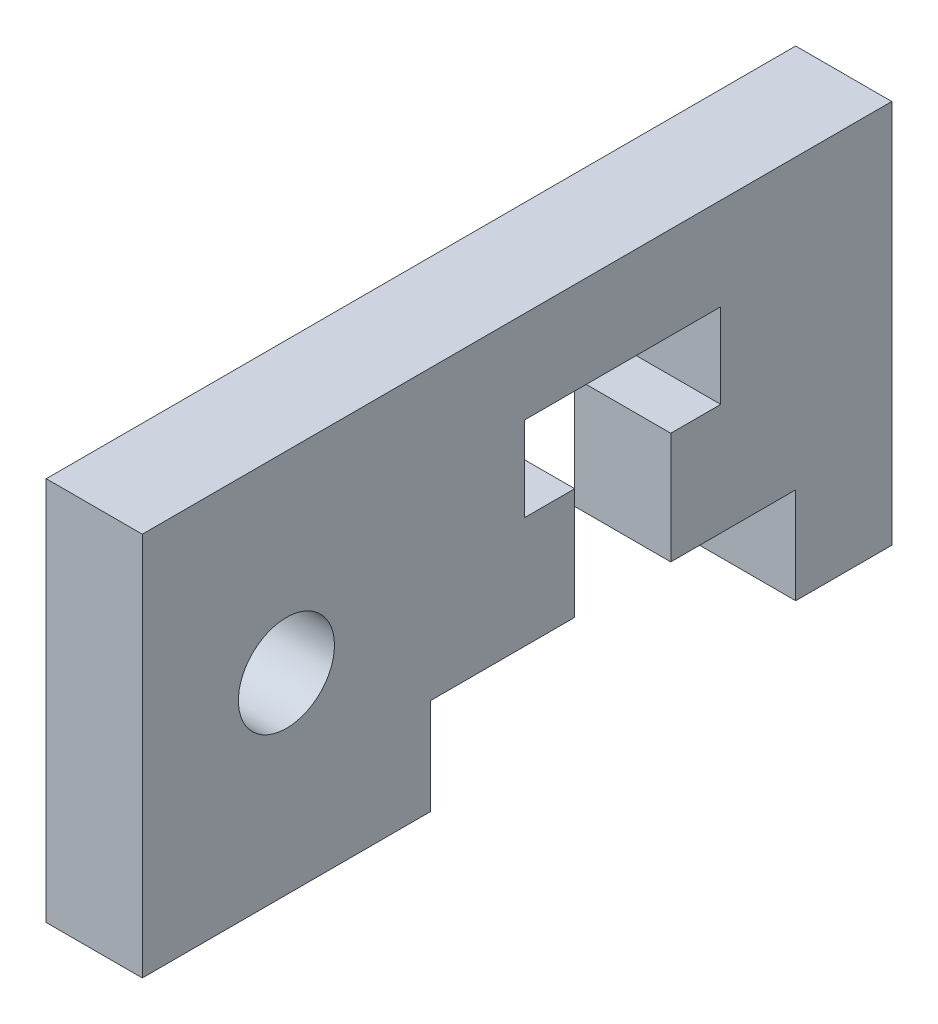
ISO-10303-21;
HEADER;
FILE_DESCRIPTION(('STEP AP214'),'2;1');
FILE_NAME('part.step','',(''),(''),'','','');
FILE_SCHEMA(('AUTOMOTIVE_DESIGN { 1 0 10303 214 1 1 1 1 }'));
ENDSEC;
DATA;
#1=APPLICATION_CONTEXT('core data for automotive mechanical design processes');
#2=APPLICATION_PROTOCOL_DEFINITION('international standard','automotive_design',2000,#1);
#3=PRODUCT_CONTEXT('',#1,'mechanical');
#4=PRODUCT('Part','Part','',(#3));
#5=PRODUCT_RELATED_PRODUCT_CATEGORY('part','',(#4));
#6=PRODUCT_DEFINITION_FORMATION('','',#4);
#7=PRODUCT_DEFINITION_CONTEXT('part definition',#1,'design');
#8=PRODUCT_DEFINITION('design','',#6,#7);
#9=PRODUCT_DEFINITION_SHAPE('','',#8);
#10=(LENGTH_UNIT() NAMED_UNIT(*) SI_UNIT(.MILLI.,.METRE.));
#11=(NAMED_UNIT(*) PLANE_ANGLE_UNIT() SI_UNIT($,.RADIAN.));
#12=(NAMED_UNIT(*) SI_UNIT($,.STERADIAN.) SOLID_ANGLE_UNIT());
#13=UNCERTAINTY_MEASURE_WITH_UNIT(LENGTH_MEASURE(1.E-05),#10,'distance_accuracy_value','');
#14=(GEOMETRIC_REPRESENTATION_CONTEXT(3) GLOBAL_UNCERTAINTY_ASSIGNED_CONTEXT((#13)) GLOBAL_UNIT_ASSIGNED_CONTEXT((#10,
#11,#12)) REPRESENTATION_CONTEXT('',''));
#15=CARTESIAN_POINT('',(0.,0.,0.));
#16=DIRECTION('',(0.,0.,1.));
#17=DIRECTION('',(1.,0.,0.));
#18=AXIS2_PLACEMENT_3D('',#15,#16,#17);
#19=CARTESIAN_POINT('',(-1.5875,6.35,-20.0025));
#20=DIRECTION('',(0.,1.,0.));
#21=DIRECTION('',(0.,0.,1.));
#22=AXIS2_PLACEMENT_3D('',#19,#20,#21);
#23=PLANE('',#22);
#24=DIRECTION('',(1.,0.,0.));
#25=VECTOR('',#24,1.);
#26=CARTESIAN_POINT('',(-1.5875,6.35,4.7625));
#27=LINE('',#26,#25);
#28=CARTESIAN_POINT('',(-1.5875,6.35,4.7625));
#29=VERTEX_POINT('',#28);
#30=CARTESIAN_POINT('',(1.5875,6.35,4.7625));
#31=VERTEX_POINT('',#30);
#32=EDGE_CURVE('E36',#29,#31,#27,.T.);
#33=ORIENTED_EDGE('',*,*,#32,.T.);
#34=DIRECTION('',(0.,0.,1.));
#35=VECTOR('',#34,1.);
#36=CARTESIAN_POINT('',(1.5875,6.35,-20.0025));
#37=LINE('',#36,#35);
#38=CARTESIAN_POINT('',(1.5875,6.35,-20.0025));
#39=VERTEX_POINT('',#38);
#40=EDGE_CURVE('E145',#39,#31,#37,.T.);
#41=ORIENTED_EDGE('',*,*,#40,.F.);
#42=DIRECTION('',(1.,0.,0.));
#43=VECTOR('',#42,1.);
#44=CARTESIAN_POINT('',(-1.5875,6.35,-20.0025));
#45=LINE('',#44,#43);
#46=CARTESIAN_POINT('',(-1.5875,6.35,-20.0025));
#47=VERTEX_POINT('',#46);
#48=EDGE_CURVE('E11',#47,#39,#45,.T.);
#49=ORIENTED_EDGE('',*,*,#48,.F.);
#50=DIRECTION('',(0.,0.,1.));
#51=VECTOR('',#50,1.);
#52=CARTESIAN_POINT('',(-1.5875,6.35,-20.0025));
#53=LINE('',#52,#51);
#54=EDGE_CURVE('E146',#47,#29,#53,.T.);
#55=ORIENTED_EDGE('',*,*,#54,.T.);
#56=EDGE_LOOP('',(#33,#41,#49,#55));
#57=FACE_BOUND('',#56,.T.);
#58=ADVANCED_FACE('F33',(#57),#23,.T.);
#59=CARTESIAN_POINT('',(-1.5875,-6.35,-20.0025));
#60=DIRECTION('',(0.,0.,-1.));
#61=DIRECTION('',(0.,1.,0.));
#62=AXIS2_PLACEMENT_3D('',#59,#60,#61);
#63=PLANE('',#62);
#64=ORIENTED_EDGE('',*,*,#48,.T.);
#65=DIRECTION('',(0.,1.,0.));
#66=VECTOR('',#65,1.);
#67=CARTESIAN_POINT('',(1.5875,-6.35,-20.0025));
#68=LINE('',#67,#66);
#69=CARTESIAN_POINT('',(1.5875,-6.35,-20.0025));
#70=VERTEX_POINT('',#69);
#71=EDGE_CURVE('E164',#70,#39,#68,.T.);
#72=ORIENTED_EDGE('',*,*,#71,.F.);
#73=DIRECTION('',(1.,0.,0.));
#74=VECTOR('',#73,1.);
#75=CARTESIAN_POINT('',(-1.5875,-6.35,-20.0025));
#76=LINE('',#75,#74);
#77=CARTESIAN_POINT('',(-1.5875,-6.35,-20.0025));
#78=VERTEX_POINT('',#77);
#79=EDGE_CURVE('E41',#78,#70,#76,.T.);
#80=ORIENTED_EDGE('',*,*,#79,.F.);
#81=DIRECTION('',(0.,1.,0.));
#82=VECTOR('',#81,1.);
#83=CARTESIAN_POINT('',(-1.5875,-6.35,-20.0025));
#84=LINE('',#83,#82);
#85=EDGE_CURVE('E151',#78,#47,#84,.T.);
#86=ORIENTED_EDGE('',*,*,#85,.T.);
#87=EDGE_LOOP('',(#64,#72,#80,#86));
#88=FACE_BOUND('',#87,.T.);
#89=ADVANCED_FACE('F330',(#88),#63,.T.);
#90=CARTESIAN_POINT('',(-1.5875,-6.35,-16.8275));
#91=DIRECTION('',(0.,-1.,0.));
#92=DIRECTION('',(0.,0.,-1.));
#93=AXIS2_PLACEMENT_3D('',#90,#91,#92);
#94=PLANE('',#93);
#95=ORIENTED_EDGE('',*,*,#79,.T.);
#96=DIRECTION('',(0.,0.,-1.));
#97=VECTOR('',#96,1.);
#98=CARTESIAN_POINT('',(1.5875,-6.35,-16.8275));
#99=LINE('',#98,#97);
#100=CARTESIAN_POINT('',(1.5875,-6.35,-16.8275));
#101=VERTEX_POINT('',#100);
#102=EDGE_CURVE('E204',#101,#70,#99,.T.);
#103=ORIENTED_EDGE('',*,*,#102,.F.);
#104=DIRECTION('',(1.,0.,0.));
#105=VECTOR('',#104,1.);
#106=CARTESIAN_POINT('',(-1.5875,-6.35,-16.8275));
#107=LINE('',#106,#105);
#108=CARTESIAN_POINT('',(-1.5875,-6.35,-16.8275));
#109=VERTEX_POINT('',#108);
#110=EDGE_CURVE('E253',#109,#101,#107,.T.);
#111=ORIENTED_EDGE('',*,*,#110,.F.);
#112=DIRECTION('',(0.,0.,-1.));
#113=VECTOR('',#112,1.);
#114=CARTESIAN_POINT('',(-1.5875,-6.35,-16.8275));
#115=LINE('',#114,#113);
#116=EDGE_CURVE('E249',#109,#78,#115,.T.);
#117=ORIENTED_EDGE('',*,*,#116,.T.);
#118=EDGE_LOOP('',(#95,#103,#111,#117));
#119=FACE_BOUND('',#118,.T.);
#120=ADVANCED_FACE('F328',(#119),#94,.T.);
#121=CARTESIAN_POINT('',(-1.5875,-3.175,-16.8275));
#122=DIRECTION('',(0.,0.,1.));
#123=DIRECTION('',(1.,0.,0.));
#124=AXIS2_PLACEMENT_3D('',#121,#122,#123);
#125=PLANE('',#124);
#126=ORIENTED_EDGE('',*,*,#110,.T.);
#127=DIRECTION('',(0.,-1.,0.));
#128=VECTOR('',#127,1.);
#129=CARTESIAN_POINT('',(1.5875,-3.175,-16.8275));
#130=LINE('',#129,#128);
#131=CARTESIAN_POINT('',(1.5875,-3.175,-16.8275));
#132=VERTEX_POINT('',#131);
#133=EDGE_CURVE('E201',#132,#101,#130,.T.);
#134=ORIENTED_EDGE('',*,*,#133,.F.);
#135=DIRECTION('',(1.,0.,0.));
#136=VECTOR('',#135,1.);
#137=CARTESIAN_POINT('',(-1.5875,-3.175,-16.8275));
#138=LINE('',#137,#136);
#139=CARTESIAN_POINT('',(-1.5875,-3.175,-16.8275));
#140=VERTEX_POINT('',#139);
#141=EDGE_CURVE('E255',#140,#132,#138,.T.);
#142=ORIENTED_EDGE('',*,*,#141,.F.);
#143=DIRECTION('',(0.,-1.,0.));
#144=VECTOR('',#143,1.);
#145=CARTESIAN_POINT('',(-1.5875,-3.175,-16.8275));
#146=LINE('',#145,#144);
#147=EDGE_CURVE('E246',#140,#109,#146,.T.);
#148=ORIENTED_EDGE('',*,*,#147,.T.);
#149=EDGE_LOOP('',(#126,#134,#142,#148));
#150=FACE_BOUND('',#149,.T.);
#151=ADVANCED_FACE('F324',(#150),#125,.T.);
#152=CARTESIAN_POINT('',(-1.5875,-3.175,-12.7));
#153=DIRECTION('',(0.,-1.,0.));
#154=DIRECTION('',(0.,0.,-1.));
#155=AXIS2_PLACEMENT_3D('',#152,#153,#154);
#156=PLANE('',#155);
#157=ORIENTED_EDGE('',*,*,#141,.T.);
#158=DIRECTION('',(0.,0.,-1.));
#159=VECTOR('',#158,1.);
#160=CARTESIAN_POINT('',(1.5875,-3.175,-12.7));
#161=LINE('',#160,#159);
#162=CARTESIAN_POINT('',(1.5875,-3.175,-12.7));
#163=VERTEX_POINT('',#162);
#164=EDGE_CURVE('E198',#163,#132,#161,.T.);
#165=ORIENTED_EDGE('',*,*,#164,.F.);
#166=DIRECTION('',(1.,0.,0.));
#167=VECTOR('',#166,1.);
#168=CARTESIAN_POINT('',(-1.5875,-3.175,-12.7));
#169=LINE('',#168,#167);
#170=CARTESIAN_POINT('',(-1.5875,-3.175,-12.7));
#171=VERTEX_POINT('',#170);
#172=EDGE_CURVE('E257',#171,#163,#169,.T.);
#173=ORIENTED_EDGE('',*,*,#172,.F.);
#174=DIRECTION('',(0.,0.,-1.));
#175=VECTOR('',#174,1.);
#176=CARTESIAN_POINT('',(-1.5875,-3.175,-12.7));
#177=LINE('',#176,#175);
#178=EDGE_CURVE('E243',#171,#140,#177,.T.);
#179=ORIENTED_EDGE('',*,*,#178,.T.);
#180=EDGE_LOOP('',(#157,#165,#173,#179));
#181=FACE_BOUND('',#180,.T.);
#182=ADVANCED_FACE('F322',(#181),#156,.T.);
#183=CARTESIAN_POINT('',(-1.5875,-3.175,-12.7));
#184=DIRECTION('',(0.,0.,1.));
#185=DIRECTION('',(1.,0.,0.));
#186=AXIS2_PLACEMENT_3D('',#183,#184,#185);
#187=PLANE('',#186);
#188=ORIENTED_EDGE('',*,*,#172,.T.);
#189=DIRECTION('',(0.,-1.,0.));
#190=VECTOR('',#189,1.);
#191=CARTESIAN_POINT('',(1.5875,-3.175,-12.7));
#192=LINE('',#191,#190);
#193=CARTESIAN_POINT('',(1.5875,0.507999999999998,-12.7));
#194=VERTEX_POINT('',#193);
#195=EDGE_CURVE('E195',#194,#163,#192,.T.);
#196=ORIENTED_EDGE('',*,*,#195,.F.);
#197=DIRECTION('',(1.,0.,0.));
#198=VECTOR('',#197,1.);
#199=CARTESIAN_POINT('',(-1.5875,0.507999999999998,-12.7));
#200=LINE('',#199,#198);
#201=CARTESIAN_POINT('',(-1.5875,0.507999999999998,-12.7));
#202=VERTEX_POINT('',#201);
#203=EDGE_CURVE('E259',#202,#194,#200,.T.);
#204=ORIENTED_EDGE('',*,*,#203,.F.);
#205=DIRECTION('',(0.,-1.,0.));
#206=VECTOR('',#205,1.);
#207=CARTESIAN_POINT('',(-1.5875,-3.175,-12.7));
#208=LINE('',#207,#206);
#209=EDGE_CURVE('E240',#202,#171,#208,.T.);
#210=ORIENTED_EDGE('',*,*,#209,.T.);
#211=EDGE_LOOP('',(#188,#196,#204,#210));
#212=FACE_BOUND('',#211,.T.);
#213=ADVANCED_FACE('F317',(#212),#187,.T.);
#214=CARTESIAN_POINT('',(-1.5875,0.507999999999998,-12.7));
#215=DIRECTION('',(0.,1.,0.));
#216=DIRECTION('',(0.,0.,1.));
#217=AXIS2_PLACEMENT_3D('',#214,#215,#216);
#218=PLANE('',#217);
#219=ORIENTED_EDGE('',*,*,#203,.T.);
#220=DIRECTION('',(0.,0.,1.));
#221=VECTOR('',#220,1.);
#222=CARTESIAN_POINT('',(1.5875,0.507999999999998,-12.7));
#223=LINE('',#222,#221);
#224=CARTESIAN_POINT('',(1.5875,0.507999999999998,-14.351));
#225=VERTEX_POINT('',#224);
#226=EDGE_CURVE('E192',#225,#194,#223,.T.);
#227=ORIENTED_EDGE('',*,*,#226,.F.);
#228=DIRECTION('',(1.,0.,0.));
#229=VECTOR('',#228,1.);
#230=CARTESIAN_POINT('',(-1.5875,0.507999999999998,-14.351));
#231=LINE('',#230,#229);
#232=CARTESIAN_POINT('',(-1.5875,0.507999999999998,-14.351));
#233=VERTEX_POINT('',#232);
#234=EDGE_CURVE('E261',#233,#225,#231,.T.);
#235=ORIENTED_EDGE('',*,*,#234,.F.);
#236=DIRECTION('',(0.,0.,1.));
#237=VECTOR('',#236,1.);
#238=CARTESIAN_POINT('',(-1.5875,0.507999999999998,-12.7));
#239=LINE('',#238,#237);
#240=EDGE_CURVE('E237',#233,#202,#239,.T.);
#241=ORIENTED_EDGE('',*,*,#240,.T.);
#242=EDGE_LOOP('',(#219,#227,#235,#241));
#243=FACE_BOUND('',#242,.T.);
#244=ADVANCED_FACE('F312',(#243),#218,.T.);
#245=CARTESIAN_POINT('',(-1.5875,0.507999999999998,-14.351));
#246=DIRECTION('',(0.,0.,1.));
#247=DIRECTION('',(1.,0.,0.));
#248=AXIS2_PLACEMENT_3D('',#245,#246,#247);
#249=PLANE('',#248);
#250=ORIENTED_EDGE('',*,*,#234,.T.);
#251=DIRECTION('',(0.,-1.,0.));
#252=VECTOR('',#251,1.);
#253=CARTESIAN_POINT('',(1.5875,0.507999999999998,-14.351));
#254=LINE('',#253,#252);
#255=CARTESIAN_POINT('',(1.5875,3.302,-14.351));
#256=VERTEX_POINT('',#255);
#257=EDGE_CURVE('E189',#256,#225,#254,.T.);
#258=ORIENTED_EDGE('',*,*,#257,.F.);
#259=DIRECTION('',(1.,0.,0.));
#260=VECTOR('',#259,1.);
#261=CARTESIAN_POINT('',(-1.5875,3.302,-14.351));
#262=LINE('',#261,#260);
#263=CARTESIAN_POINT('',(-1.5875,3.302,-14.351));
#264=VERTEX_POINT('',#263);
#265=EDGE_CURVE('E263',#264,#256,#262,.T.);
#266=ORIENTED_EDGE('',*,*,#265,.F.);
#267=DIRECTION('',(0.,-1.,0.));
#268=VECTOR('',#267,1.);
#269=CARTESIAN_POINT('',(-1.5875,0.507999999999998,-14.351));
#270=LINE('',#269,#268);
#271=EDGE_CURVE('E234',#264,#233,#270,.T.);
#272=ORIENTED_EDGE('',*,*,#271,.T.);
#273=EDGE_LOOP('',(#250,#258,#266,#272));
#274=FACE_BOUND('',#273,.T.);
#275=ADVANCED_FACE('F310',(#274),#249,.T.);
#276=CARTESIAN_POINT('',(-1.5875,3.302,-14.351));
#277=DIRECTION('',(0.,-1.,0.));
#278=DIRECTION('',(0.,0.,-1.));
#279=AXIS2_PLACEMENT_3D('',#276,#277,#278);
#280=PLANE('',#279);
#281=ORIENTED_EDGE('',*,*,#265,.T.);
#282=DIRECTION('',(0.,0.,-1.));
#283=VECTOR('',#282,1.);
#284=CARTESIAN_POINT('',(1.5875,3.302,-14.351));
#285=LINE('',#284,#283);
#286=CARTESIAN_POINT('',(1.5875,3.302,-7.874));
#287=VERTEX_POINT('',#286);
#288=EDGE_CURVE('E186',#287,#256,#285,.T.);
#289=ORIENTED_EDGE('',*,*,#288,.F.);
#290=DIRECTION('',(1.,0.,0.));
#291=VECTOR('',#290,1.);
#292=CARTESIAN_POINT('',(-1.5875,3.302,-7.874));
#293=LINE('',#292,#291);
#294=CARTESIAN_POINT('',(-1.5875,3.302,-7.874));
#295=VERTEX_POINT('',#294);
#296=EDGE_CURVE('E265',#295,#287,#293,.T.);
#297=ORIENTED_EDGE('',*,*,#296,.F.);
#298=DIRECTION('',(0.,0.,-1.));
#299=VECTOR('',#298,1.);
#300=CARTESIAN_POINT('',(-1.5875,3.302,-14.351));
#301=LINE('',#300,#299);
#302=EDGE_CURVE('E231',#295,#264,#301,.T.);
#303=ORIENTED_EDGE('',*,*,#302,.T.);
#304=EDGE_LOOP('',(#281,#289,#297,#303));
#305=FACE_BOUND('',#304,.T.);
#306=ADVANCED_FACE('F305',(#305),#280,.T.);
#307=CARTESIAN_POINT('',(-1.5875,3.302,-7.874));
#308=DIRECTION('',(0.,0.,-1.));
#309=DIRECTION('',(-1.,0.,0.));
#310=AXIS2_PLACEMENT_3D('',#307,#308,#309);
#311=PLANE('',#310);
#312=ORIENTED_EDGE('',*,*,#296,.T.);
#313=DIRECTION('',(0.,1.,0.));
#314=VECTOR('',#313,1.);
#315=CARTESIAN_POINT('',(1.5875,3.302,-7.874));
#316=LINE('',#315,#314);
#317=CARTESIAN_POINT('',(1.5875,0.507999999999998,-7.874));
#318=VERTEX_POINT('',#317);
#319=EDGE_CURVE('E183',#318,#287,#316,.T.);
#320=ORIENTED_EDGE('',*,*,#319,.F.);
#321=DIRECTION('',(1.,0.,0.));
#322=VECTOR('',#321,1.);
#323=CARTESIAN_POINT('',(-1.5875,0.507999999999998,-7.874));
#324=LINE('',#323,#322);
#325=CARTESIAN_POINT('',(-1.5875,0.507999999999998,-7.874));
#326=VERTEX_POINT('',#325);
#327=EDGE_CURVE('E267',#326,#318,#324,.T.);
#328=ORIENTED_EDGE('',*,*,#327,.F.);
#329=DIRECTION('',(0.,1.,0.));
#330=VECTOR('',#329,1.);
#331=CARTESIAN_POINT('',(-1.5875,3.302,-7.874));
#332=LINE('',#331,#330);
#333=EDGE_CURVE('E228',#326,#295,#332,.T.);
#334=ORIENTED_EDGE('',*,*,#333,.T.);
#335=EDGE_LOOP('',(#312,#320,#328,#334));
#336=FACE_BOUND('',#335,.T.);
#337=ADVANCED_FACE('F300',(#336),#311,.T.);
#338=CARTESIAN_POINT('',(-1.5875,0.507999999999998,-7.874));
#339=DIRECTION('',(0.,1.,0.));
#340=DIRECTION('',(0.,0.,1.));
#341=AXIS2_PLACEMENT_3D('',#338,#339,#340);
#342=PLANE('',#341);
#343=ORIENTED_EDGE('',*,*,#327,.T.);
#344=DIRECTION('',(0.,0.,1.));
#345=VECTOR('',#344,1.);
#346=CARTESIAN_POINT('',(1.5875,0.507999999999998,-7.874));
#347=LINE('',#346,#345);
#348=CARTESIAN_POINT('',(1.5875,0.507999999999998,-9.525));
#349=VERTEX_POINT('',#348);
#350=EDGE_CURVE('E180',#349,#318,#347,.T.);
#351=ORIENTED_EDGE('',*,*,#350,.F.);
#352=DIRECTION('',(1.,0.,0.));
#353=VECTOR('',#352,1.);
#354=CARTESIAN_POINT('',(-1.5875,0.507999999999998,-9.525));
#355=LINE('',#354,#353);
#356=CARTESIAN_POINT('',(-1.5875,0.507999999999998,-9.525));
#357=VERTEX_POINT('',#356);
#358=EDGE_CURVE('E269',#357,#349,#355,.T.);
#359=ORIENTED_EDGE('',*,*,#358,.F.);
#360=DIRECTION('',(0.,0.,1.));
#361=VECTOR('',#360,1.);
#362=CARTESIAN_POINT('',(-1.5875,0.507999999999998,-7.874));
#363=LINE('',#362,#361);
#364=EDGE_CURVE('E225',#357,#326,#363,.T.);
#365=ORIENTED_EDGE('',*,*,#364,.T.);
#366=EDGE_LOOP('',(#343,#351,#359,#365));
#367=FACE_BOUND('',#366,.T.);
#368=ADVANCED_FACE('F298',(#367),#342,.T.);
#369=CARTESIAN_POINT('',(-1.5875,0.507999999999998,-9.525));
#370=DIRECTION('',(0.,0.,-1.));
#371=DIRECTION('',(0.,1.,0.));
#372=AXIS2_PLACEMENT_3D('',#369,#370,#371);
#373=PLANE('',#372);
#374=ORIENTED_EDGE('',*,*,#358,.T.);
#375=DIRECTION('',(0.,1.,0.));
#376=VECTOR('',#375,1.);
#377=CARTESIAN_POINT('',(1.5875,0.507999999999998,-9.525));
#378=LINE('',#377,#376);
#379=CARTESIAN_POINT('',(1.5875,-3.175,-9.525));
#380=VERTEX_POINT('',#379);
#381=EDGE_CURVE('E177',#380,#349,#378,.T.);
#382=ORIENTED_EDGE('',*,*,#381,.F.);
#383=DIRECTION('',(1.,0.,0.));
#384=VECTOR('',#383,1.);
#385=CARTESIAN_POINT('',(-1.5875,-3.175,-9.525));
#386=LINE('',#385,#384);
#387=CARTESIAN_POINT('',(-1.5875,-3.175,-9.525));
#388=VERTEX_POINT('',#387);
#389=EDGE_CURVE('E271',#388,#380,#386,.T.);
#390=ORIENTED_EDGE('',*,*,#389,.F.);
#391=DIRECTION('',(0.,1.,0.));
#392=VECTOR('',#391,1.);
#393=CARTESIAN_POINT('',(-1.5875,0.507999999999998,-9.525));
#394=LINE('',#393,#392);
#395=EDGE_CURVE('E222',#388,#357,#394,.T.);
#396=ORIENTED_EDGE('',*,*,#395,.T.);
#397=EDGE_LOOP('',(#374,#382,#390,#396));
#398=FACE_BOUND('',#397,.T.);
#399=ADVANCED_FACE('F293',(#398),#373,.T.);
#400=CARTESIAN_POINT('',(-1.5875,-3.175,-9.525));
#401=DIRECTION('',(0.,-1.,0.));
#402=DIRECTION('',(0.,0.,-1.));
#403=AXIS2_PLACEMENT_3D('',#400,#401,#402);
#404=PLANE('',#403);
#405=ORIENTED_EDGE('',*,*,#389,.T.);
#406=DIRECTION('',(0.,0.,-1.));
#407=VECTOR('',#406,1.);
#408=CARTESIAN_POINT('',(1.5875,-3.175,-9.525));
#409=LINE('',#408,#407);
#410=CARTESIAN_POINT('',(1.5875,-3.175,-4.7625));
#411=VERTEX_POINT('',#410);
#412=EDGE_CURVE('E174',#411,#380,#409,.T.);
#413=ORIENTED_EDGE('',*,*,#412,.F.);
#414=DIRECTION('',(1.,0.,0.));
#415=VECTOR('',#414,1.);
#416=CARTESIAN_POINT('',(-1.5875,-3.175,-4.7625));
#417=LINE('',#416,#415);
#418=CARTESIAN_POINT('',(-1.5875,-3.175,-4.7625));
#419=VERTEX_POINT('',#418);
#420=EDGE_CURVE('E273',#419,#411,#417,.T.);
#421=ORIENTED_EDGE('',*,*,#420,.F.);
#422=DIRECTION('',(0.,0.,-1.));
#423=VECTOR('',#422,1.);
#424=CARTESIAN_POINT('',(-1.5875,-3.175,-9.525));
#425=LINE('',#424,#423);
#426=EDGE_CURVE('E219',#419,#388,#425,.T.);
#427=ORIENTED_EDGE('',*,*,#426,.T.);
#428=EDGE_LOOP('',(#405,#413,#421,#427));
#429=FACE_BOUND('',#428,.T.);
#430=ADVANCED_FACE('F286',(#429),#404,.T.);
#431=CARTESIAN_POINT('',(-1.5875,-6.35,-4.7625));
#432=DIRECTION('',(0.,0.,-1.));
#433=DIRECTION('',(-1.,0.,0.));
#434=AXIS2_PLACEMENT_3D('',#431,#432,#433);
#435=PLANE('',#434);
#436=ORIENTED_EDGE('',*,*,#420,.T.);
#437=DIRECTION('',(0.,1.,0.));
#438=VECTOR('',#437,1.);
#439=CARTESIAN_POINT('',(1.5875,-6.35,-4.7625));
#440=LINE('',#439,#438);
#441=CARTESIAN_POINT('',(1.5875,-6.35,-4.7625));
#442=VERTEX_POINT('',#441);
#443=EDGE_CURVE('E171',#442,#411,#440,.T.);
#444=ORIENTED_EDGE('',*,*,#443,.F.);
#445=DIRECTION('',(1.,0.,0.));
#446=VECTOR('',#445,1.);
#447=CARTESIAN_POINT('',(-1.5875,-6.35,-4.7625));
#448=LINE('',#447,#446);
#449=CARTESIAN_POINT('',(-1.5875,-6.35,-4.7625));
#450=VERTEX_POINT('',#449);
#451=EDGE_CURVE('E275',#450,#442,#448,.T.);
#452=ORIENTED_EDGE('',*,*,#451,.F.);
#453=DIRECTION('',(0.,1.,0.));
#454=VECTOR('',#453,1.);
#455=CARTESIAN_POINT('',(-1.5875,-6.35,-4.7625));
#456=LINE('',#455,#454);
#457=EDGE_CURVE('E216',#450,#419,#456,.T.);
#458=ORIENTED_EDGE('',*,*,#457,.T.);
#459=EDGE_LOOP('',(#436,#444,#452,#458));
#460=FACE_BOUND('',#459,.T.);
#461=ADVANCED_FACE('F283',(#460),#435,.T.);
#462=CARTESIAN_POINT('',(-1.5875,-6.35,4.7625));
#463=DIRECTION('',(0.,-1.,0.));
#464=DIRECTION('',(0.,0.,-1.));
#465=AXIS2_PLACEMENT_3D('',#462,#463,#464);
#466=PLANE('',#465);
#467=ORIENTED_EDGE('',*,*,#451,.T.);
#468=DIRECTION('',(0.,0.,-1.));
#469=VECTOR('',#468,1.);
#470=CARTESIAN_POINT('',(1.5875,-6.35,4.7625));
#471=LINE('',#470,#469);
#472=CARTESIAN_POINT('',(1.5875,-6.35,4.7625));
#473=VERTEX_POINT('',#472);
#474=EDGE_CURVE('E158',#473,#442,#471,.T.);
#475=ORIENTED_EDGE('',*,*,#474,.F.);
#476=DIRECTION('',(1.,0.,0.));
#477=VECTOR('',#476,1.);
#478=CARTESIAN_POINT('',(-1.5875,-6.35,4.7625));
#479=LINE('',#478,#477);
#480=CARTESIAN_POINT('',(-1.5875,-6.35,4.7625));
#481=VERTEX_POINT('',#480);
#482=EDGE_CURVE('E150',#481,#473,#479,.T.);
#483=ORIENTED_EDGE('',*,*,#482,.F.);
#484=DIRECTION('',(0.,0.,-1.));
#485=VECTOR('',#484,1.);
#486=CARTESIAN_POINT('',(-1.5875,-6.35,4.7625));
#487=LINE('',#486,#485);
#488=EDGE_CURVE('E213',#481,#450,#487,.T.);
#489=ORIENTED_EDGE('',*,*,#488,.T.);
#490=EDGE_LOOP('',(#467,#475,#483,#489));
#491=FACE_BOUND('',#490,.T.);
#492=ADVANCED_FACE('F277',(#491),#466,.T.);
#493=CARTESIAN_POINT('',(-1.5875,6.35,4.7625));
#494=DIRECTION('',(0.,0.,1.));
#495=DIRECTION('',(0.,-1.,0.));
#496=AXIS2_PLACEMENT_3D('',#493,#494,#495);
#497=PLANE('',#496);
#498=ORIENTED_EDGE('',*,*,#482,.T.);
#499=DIRECTION('',(0.,-1.,0.));
#500=VECTOR('',#499,1.);
#501=CARTESIAN_POINT('',(1.5875,6.35,4.7625));
#502=LINE('',#501,#500);
#503=EDGE_CURVE('E153',#31,#473,#502,.T.);
#504=ORIENTED_EDGE('',*,*,#503,.F.);
#505=ORIENTED_EDGE('',*,*,#32,.F.);
#506=DIRECTION('',(0.,-1.,0.));
#507=VECTOR('',#506,1.);
#508=CARTESIAN_POINT('',(-1.5875,6.35,4.7625));
#509=LINE('',#508,#507);
#510=EDGE_CURVE('E211',#29,#481,#509,.T.);
#511=ORIENTED_EDGE('',*,*,#510,.T.);
#512=EDGE_LOOP('',(#498,#504,#505,#511));
#513=FACE_BOUND('',#512,.T.);
#514=ADVANCED_FACE('F154',(#513),#497,.T.);
#515=CARTESIAN_POINT('',(-1.5875,6.35,4.7625));
#516=DIRECTION('',(1.,0.,0.));
#517=DIRECTION('',(0.,0.,-1.));
#518=AXIS2_PLACEMENT_3D('',#515,#516,#517);
#519=PLANE('',#518);
#520=CARTESIAN_POINT('',(-1.5875,0.,0.));
#521=DIRECTION('',(1.,0.,0.));
#522=DIRECTION('',(0.,0.,-1.));
#523=AXIS2_PLACEMENT_3D('',#520,#521,#522);
#524=CIRCLE('',#523,1.5875);
#525=CARTESIAN_POINT('',(-1.5875,0.,-1.5875));
#526=VERTEX_POINT('',#525);
#527=EDGE_CURVE('E207',#526,#526,#524,.T.);
#528=ORIENTED_EDGE('',*,*,#527,.T.);
#529=EDGE_LOOP('',(#528));
#530=FACE_BOUND('',#529,.T.);
#531=ORIENTED_EDGE('',*,*,#54,.F.);
#532=ORIENTED_EDGE('',*,*,#85,.F.);
#533=ORIENTED_EDGE('',*,*,#116,.F.);
#534=ORIENTED_EDGE('',*,*,#147,.F.);
#535=ORIENTED_EDGE('',*,*,#178,.F.);
#536=ORIENTED_EDGE('',*,*,#209,.F.);
#537=ORIENTED_EDGE('',*,*,#240,.F.);
#538=ORIENTED_EDGE('',*,*,#271,.F.);
#539=ORIENTED_EDGE('',*,*,#302,.F.);
#540=ORIENTED_EDGE('',*,*,#333,.F.);
#541=ORIENTED_EDGE('',*,*,#364,.F.);
#542=ORIENTED_EDGE('',*,*,#395,.F.);
#543=ORIENTED_EDGE('',*,*,#426,.F.);
#544=ORIENTED_EDGE('',*,*,#457,.F.);
#545=ORIENTED_EDGE('',*,*,#488,.F.);
#546=ORIENTED_EDGE('',*,*,#510,.F.);
#547=EDGE_LOOP('',(#531,#532,#533,#534,#535,#536,#537,#538,#539,#540,#541,#542,#543,#544,#545,#546));
#548=FACE_BOUND('',#547,.T.);
#549=ADVANCED_FACE('F289',(#530,#548),#519,.F.);
#550=CARTESIAN_POINT('',(-1.5875,0.,0.));
#551=DIRECTION('',(1.,0.,0.));
#552=DIRECTION('',(0.,0.,-1.));
#553=AXIS2_PLACEMENT_3D('',#550,#551,#552);
#554=CYLINDRICAL_SURFACE('',#553,1.5875);
#555=ORIENTED_EDGE('',*,*,#527,.F.);
#556=EDGE_LOOP('',(#555));
#557=FACE_BOUND('',#556,.T.);
#558=CARTESIAN_POINT('',(1.5875,0.,0.));
#559=DIRECTION('',(1.,0.,0.));
#560=DIRECTION('',(0.,0.,-1.));
#561=AXIS2_PLACEMENT_3D('',#558,#559,#560);
#562=CIRCLE('',#561,1.5875);
#563=CARTESIAN_POINT('',(1.5875,0.,-1.5875));
#564=VERTEX_POINT('',#563);
#565=EDGE_CURVE('E165',#564,#564,#562,.T.);
#566=ORIENTED_EDGE('',*,*,#565,.T.);
#567=EDGE_LOOP('',(#566));
#568=FACE_BOUND('',#567,.T.);
#569=ADVANCED_FACE('F368',(#557,#568),#554,.F.);
#570=CARTESIAN_POINT('',(1.5875,6.35,4.7625));
#571=DIRECTION('',(1.,0.,0.));
#572=DIRECTION('',(0.,0.,-1.));
#573=AXIS2_PLACEMENT_3D('',#570,#571,#572);
#574=PLANE('',#573);
#575=ORIENTED_EDGE('',*,*,#40,.T.);
#576=ORIENTED_EDGE('',*,*,#503,.T.);
#577=ORIENTED_EDGE('',*,*,#474,.T.);
#578=ORIENTED_EDGE('',*,*,#443,.T.);
#579=ORIENTED_EDGE('',*,*,#412,.T.);
#580=ORIENTED_EDGE('',*,*,#381,.T.);
#581=ORIENTED_EDGE('',*,*,#350,.T.);
#582=ORIENTED_EDGE('',*,*,#319,.T.);
#583=ORIENTED_EDGE('',*,*,#288,.T.);
#584=ORIENTED_EDGE('',*,*,#257,.T.);
#585=ORIENTED_EDGE('',*,*,#226,.T.);
#586=ORIENTED_EDGE('',*,*,#195,.T.);
#587=ORIENTED_EDGE('',*,*,#164,.T.);
#588=ORIENTED_EDGE('',*,*,#133,.T.);
#589=ORIENTED_EDGE('',*,*,#102,.T.);
#590=ORIENTED_EDGE('',*,*,#71,.T.);
#591=EDGE_LOOP('',(#575,#576,#577,#578,#579,#580,#581,#582,#583,#584,#585,#586,#587,#588,#589,#590));
#592=FACE_BOUND('',#591,.T.);
#593=ORIENTED_EDGE('',*,*,#565,.F.);
#594=EDGE_LOOP('',(#593));
#595=FACE_BOUND('',#594,.T.);
#596=ADVANCED_FACE('F161',(#592,#595),#574,.T.);
#597=CLOSED_SHELL('',(#58,#89,#120,#151,#182,#213,#244,#275,#306,#337,#368,#399,#430,#461,#492,
#514,#549,#569,#596));
#598=MANIFOLD_SOLID_BREP('B2',#597);
#599=ADVANCED_BREP_SHAPE_REPRESENTATION('',(#18,#598),#14);
#600=SHAPE_DEFINITION_REPRESENTATION(#9,#599);
ENDSEC;
END-ISO-10303-21;
